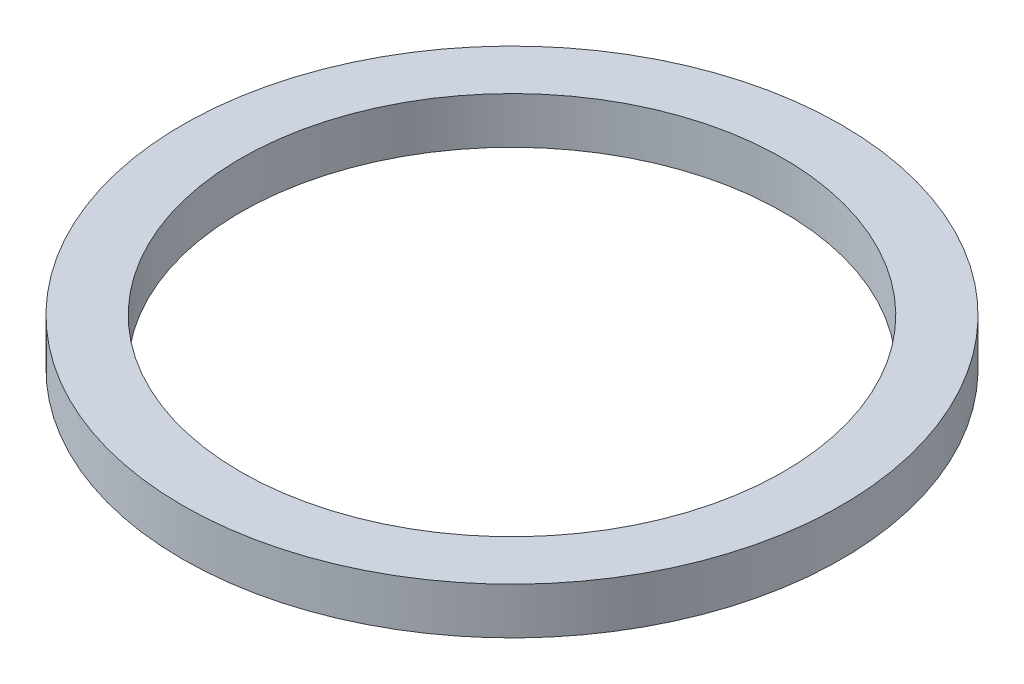
ISO-10303-21;
HEADER;
FILE_DESCRIPTION(('STEP AP214'),'2;1');
FILE_NAME('part.step','',(''),(''),'','','');
FILE_SCHEMA(('AUTOMOTIVE_DESIGN { 1 0 10303 214 1 1 1 1 }'));
ENDSEC;
DATA;
#1=APPLICATION_CONTEXT('core data for automotive mechanical design processes');
#2=APPLICATION_PROTOCOL_DEFINITION('international standard','automotive_design',2000,#1);
#3=PRODUCT_CONTEXT('',#1,'mechanical');
#4=PRODUCT('Part','Part','',(#3));
#5=PRODUCT_RELATED_PRODUCT_CATEGORY('part','',(#4));
#6=PRODUCT_DEFINITION_FORMATION('','',#4);
#7=PRODUCT_DEFINITION_CONTEXT('part definition',#1,'design');
#8=PRODUCT_DEFINITION('design','',#6,#7);
#9=PRODUCT_DEFINITION_SHAPE('','',#8);
#10=(LENGTH_UNIT() NAMED_UNIT(*) SI_UNIT(.MILLI.,.METRE.));
#11=(NAMED_UNIT(*) PLANE_ANGLE_UNIT() SI_UNIT($,.RADIAN.));
#12=(NAMED_UNIT(*) SI_UNIT($,.STERADIAN.) SOLID_ANGLE_UNIT());
#13=UNCERTAINTY_MEASURE_WITH_UNIT(LENGTH_MEASURE(1.E-05),#10,'distance_accuracy_value','');
#14=(GEOMETRIC_REPRESENTATION_CONTEXT(3) GLOBAL_UNCERTAINTY_ASSIGNED_CONTEXT((#13)) GLOBAL_UNIT_ASSIGNED_CONTEXT((#10,
#11,#12)) REPRESENTATION_CONTEXT('',''));
#15=CARTESIAN_POINT('',(0.,0.,0.));
#16=DIRECTION('',(0.,0.,1.));
#17=DIRECTION('',(1.,0.,0.));
#18=AXIS2_PLACEMENT_3D('',#15,#16,#17);
#19=CARTESIAN_POINT('',(0.,6.,0.));
#20=DIRECTION('',(0.,-1.,0.));
#21=DIRECTION('',(0.,0.,-1.));
#22=AXIS2_PLACEMENT_3D('',#19,#20,#21);
#23=CYLINDRICAL_SURFACE('',#22,42.5);
#24=CARTESIAN_POINT('',(0.,6.,0.));
#25=DIRECTION('',(0.,1.,0.));
#26=DIRECTION('',(0.,0.,1.));
#27=AXIS2_PLACEMENT_3D('',#24,#25,#26);
#28=CIRCLE('',#27,42.5);
#29=CARTESIAN_POINT('',(0.,6.,42.5));
#30=VERTEX_POINT('',#29);
#31=EDGE_CURVE('E10',#30,#30,#28,.T.);
#32=ORIENTED_EDGE('',*,*,#31,.F.);
#33=EDGE_LOOP('',(#32));
#34=FACE_BOUND('',#33,.T.);
#35=CARTESIAN_POINT('',(0.,0.,0.));
#36=DIRECTION('',(0.,1.,0.));
#37=DIRECTION('',(0.,0.,1.));
#38=AXIS2_PLACEMENT_3D('',#35,#36,#37);
#39=CIRCLE('',#38,42.5);
#40=CARTESIAN_POINT('',(0.,0.,42.5));
#41=VERTEX_POINT('',#40);
#42=EDGE_CURVE('E37',#41,#41,#39,.T.);
#43=ORIENTED_EDGE('',*,*,#42,.T.);
#44=EDGE_LOOP('',(#43));
#45=FACE_BOUND('',#44,.T.);
#46=ADVANCED_FACE('F40',(#34,#45),#23,.T.);
#47=CARTESIAN_POINT('',(0.,6.,0.));
#48=DIRECTION('',(0.,1.,0.));
#49=DIRECTION('',(0.,0.,1.));
#50=AXIS2_PLACEMENT_3D('',#47,#48,#49);
#51=PLANE('',#50);
#52=CARTESIAN_POINT('',(0.,6.,0.));
#53=DIRECTION('',(0.,1.,0.));
#54=DIRECTION('',(0.,0.,1.));
#55=AXIS2_PLACEMENT_3D('',#52,#53,#54);
#56=CIRCLE('',#55,35.);
#57=CARTESIAN_POINT('',(0.,6.,35.));
#58=VERTEX_POINT('',#57);
#59=EDGE_CURVE('E50',#58,#58,#56,.T.);
#60=ORIENTED_EDGE('',*,*,#59,.F.);
#61=EDGE_LOOP('',(#60));
#62=FACE_BOUND('',#61,.T.);
#63=ORIENTED_EDGE('',*,*,#31,.T.);
#64=EDGE_LOOP('',(#63));
#65=FACE_BOUND('',#64,.T.);
#66=ADVANCED_FACE('F59',(#62,#65),#51,.T.);
#67=CARTESIAN_POINT('',(0.,0.,0.));
#68=DIRECTION('',(0.,1.,0.));
#69=DIRECTION('',(0.,0.,1.));
#70=AXIS2_PLACEMENT_3D('',#67,#68,#69);
#71=PLANE('',#70);
#72=CARTESIAN_POINT('',(0.,0.,0.));
#73=DIRECTION('',(0.,1.,0.));
#74=DIRECTION('',(0.,0.,1.));
#75=AXIS2_PLACEMENT_3D('',#72,#73,#74);
#76=CIRCLE('',#75,35.);
#77=CARTESIAN_POINT('',(0.,0.,35.));
#78=VERTEX_POINT('',#77);
#79=EDGE_CURVE('E47',#78,#78,#76,.T.);
#80=ORIENTED_EDGE('',*,*,#79,.T.);
#81=EDGE_LOOP('',(#80));
#82=FACE_BOUND('',#81,.T.);
#83=ORIENTED_EDGE('',*,*,#42,.F.);
#84=EDGE_LOOP('',(#83));
#85=FACE_BOUND('',#84,.T.);
#86=ADVANCED_FACE('F58',(#82,#85),#71,.F.);
#87=CARTESIAN_POINT('',(0.,6.,0.));
#88=DIRECTION('',(0.,-1.,0.));
#89=DIRECTION('',(0.,0.,-1.));
#90=AXIS2_PLACEMENT_3D('',#87,#88,#89);
#91=CYLINDRICAL_SURFACE('',#90,35.);
#92=ORIENTED_EDGE('',*,*,#59,.T.);
#93=EDGE_LOOP('',(#92));
#94=FACE_BOUND('',#93,.T.);
#95=ORIENTED_EDGE('',*,*,#79,.F.);
#96=EDGE_LOOP('',(#95));
#97=FACE_BOUND('',#96,.T.);
#98=ADVANCED_FACE('F54',(#94,#97),#91,.F.);
#99=CLOSED_SHELL('',(#46,#66,#86,#98));
#100=MANIFOLD_SOLID_BREP('B2',#99);
#101=ADVANCED_BREP_SHAPE_REPRESENTATION('',(#18,#100),#14);
#102=SHAPE_DEFINITION_REPRESENTATION(#9,#101);
ENDSEC;
END-ISO-10303-21;
